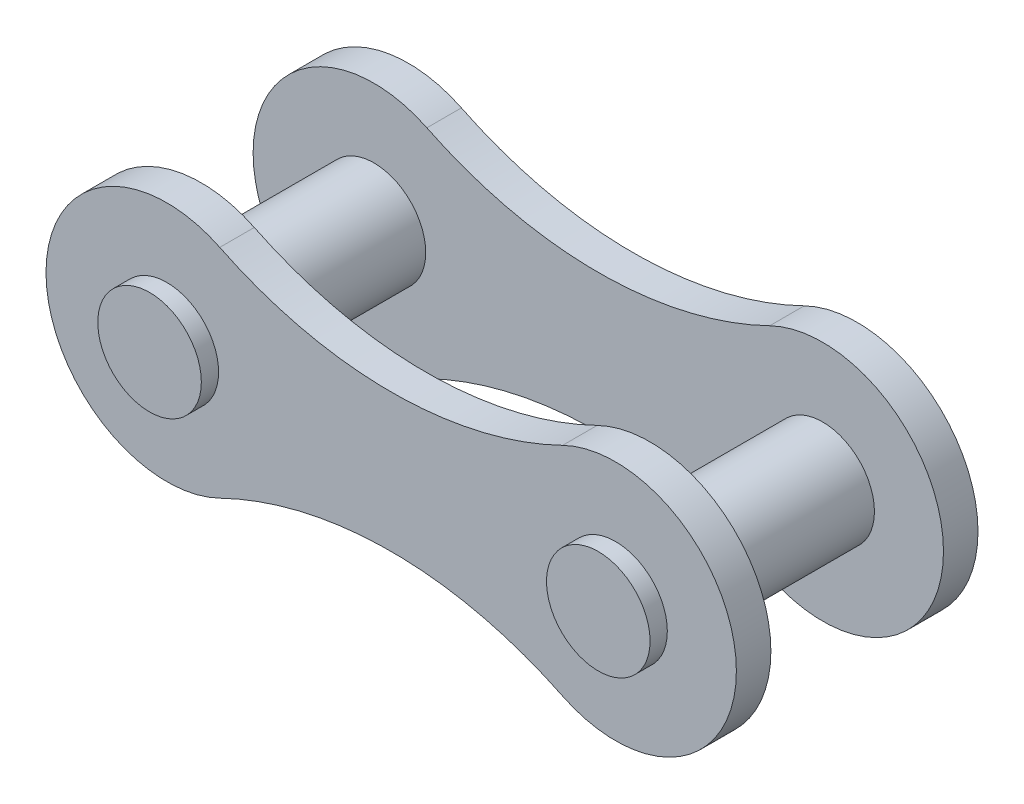
ISO-10303-21;
HEADER;
FILE_DESCRIPTION(('STEP AP214'),'2;1');
FILE_NAME('part.step','',(''),(''),'','','');
FILE_SCHEMA(('AUTOMOTIVE_DESIGN { 1 0 10303 214 1 1 1 1 }'));
ENDSEC;
DATA;
#1=APPLICATION_CONTEXT('core data for automotive mechanical design processes');
#2=APPLICATION_PROTOCOL_DEFINITION('international standard','automotive_design',2000,#1);
#3=PRODUCT_CONTEXT('',#1,'mechanical');
#4=PRODUCT('Part','Part','',(#3));
#5=PRODUCT_RELATED_PRODUCT_CATEGORY('part','',(#4));
#6=PRODUCT_DEFINITION_FORMATION('','',#4);
#7=PRODUCT_DEFINITION_CONTEXT('part definition',#1,'design');
#8=PRODUCT_DEFINITION('design','',#6,#7);
#9=PRODUCT_DEFINITION_SHAPE('','',#8);
#10=(LENGTH_UNIT() NAMED_UNIT(*) SI_UNIT(.MILLI.,.METRE.));
#11=(NAMED_UNIT(*) PLANE_ANGLE_UNIT() SI_UNIT($,.RADIAN.));
#12=(NAMED_UNIT(*) SI_UNIT($,.STERADIAN.) SOLID_ANGLE_UNIT());
#13=UNCERTAINTY_MEASURE_WITH_UNIT(LENGTH_MEASURE(1.E-05),#10,'distance_accuracy_value','');
#14=(GEOMETRIC_REPRESENTATION_CONTEXT(3) GLOBAL_UNCERTAINTY_ASSIGNED_CONTEXT((#13)) GLOBAL_UNIT_ASSIGNED_CONTEXT((#10,
#11,#12)) REPRESENTATION_CONTEXT('',''));
#15=CARTESIAN_POINT('',(0.,0.,0.));
#16=DIRECTION('',(0.,0.,1.));
#17=DIRECTION('',(1.,0.,0.));
#18=AXIS2_PLACEMENT_3D('',#15,#16,#17);
#19=CARTESIAN_POINT('',(3.25,6.66666666666667,1.));
#20=DIRECTION('',(0.,0.,1.));
#21=DIRECTION('',(1.,0.,0.));
#22=AXIS2_PLACEMENT_3D('',#19,#20,#21);
#23=PLANE('',#22);
#24=CARTESIAN_POINT('',(-6.5,0.,1.));
#25=DIRECTION('',(0.,0.,1.));
#26=DIRECTION('',(1.,0.,0.));
#27=AXIS2_PLACEMENT_3D('',#24,#25,#26);
#28=CIRCLE('',#27,1.5);
#29=CARTESIAN_POINT('',(-5.,0.,1.));
#30=VERTEX_POINT('',#29);
#31=EDGE_CURVE('E141',#30,#30,#28,.T.);
#32=ORIENTED_EDGE('',*,*,#31,.F.);
#33=EDGE_LOOP('',(#32));
#34=FACE_BOUND('',#33,.T.);
#35=CARTESIAN_POINT('',(6.5,0.,1.));
#36=DIRECTION('',(0.,0.,1.));
#37=DIRECTION('',(1.,0.,0.));
#38=AXIS2_PLACEMENT_3D('',#35,#36,#37);
#39=CIRCLE('',#38,1.5);
#40=CARTESIAN_POINT('',(8.,0.,1.));
#41=VERTEX_POINT('',#40);
#42=EDGE_CURVE('E271',#41,#41,#39,.T.);
#43=ORIENTED_EDGE('',*,*,#42,.F.);
#44=EDGE_LOOP('',(#43));
#45=FACE_BOUND('',#44,.T.);
#46=CARTESIAN_POINT('',(0.,13.3333333333333,1.));
#47=DIRECTION('',(0.,0.,-1.));
#48=DIRECTION('',(1.,0.,0.));
#49=AXIS2_PLACEMENT_3D('',#46,#47,#48);
#50=CIRCLE('',#49,11.3333333333333);
#51=CARTESIAN_POINT('',(4.96629213483146,3.14606741573034,1.));
#52=VERTEX_POINT('',#51);
#53=CARTESIAN_POINT('',(-4.96629213483146,3.14606741573034,1.));
#54=VERTEX_POINT('',#53);
#55=EDGE_CURVE('E168',#52,#54,#50,.T.);
#56=ORIENTED_EDGE('',*,*,#55,.T.);
#57=CARTESIAN_POINT('',(-6.5,0.,1.));
#58=DIRECTION('',(0.,0.,1.));
#59=DIRECTION('',(-1.,0.,0.));
#60=AXIS2_PLACEMENT_3D('',#57,#58,#59);
#61=CIRCLE('',#60,3.5);
#62=CARTESIAN_POINT('',(-4.96629213483146,-3.14606741573034,1.));
#63=VERTEX_POINT('',#62);
#64=EDGE_CURVE('E85',#54,#63,#61,.T.);
#65=ORIENTED_EDGE('',*,*,#64,.T.);
#66=CARTESIAN_POINT('',(0.,-13.3333333333333,1.));
#67=DIRECTION('',(0.,0.,-1.));
#68=DIRECTION('',(-1.,0.,0.));
#69=AXIS2_PLACEMENT_3D('',#66,#67,#68);
#70=CIRCLE('',#69,11.3333333333333);
#71=CARTESIAN_POINT('',(4.96629213483146,-3.14606741573034,1.));
#72=VERTEX_POINT('',#71);
#73=EDGE_CURVE('E171',#63,#72,#70,.T.);
#74=ORIENTED_EDGE('',*,*,#73,.T.);
#75=CARTESIAN_POINT('',(6.5,0.,1.));
#76=DIRECTION('',(0.,0.,1.));
#77=DIRECTION('',(1.,0.,0.));
#78=AXIS2_PLACEMENT_3D('',#75,#76,#77);
#79=CIRCLE('',#78,3.5);
#80=EDGE_CURVE('E54',#72,#52,#79,.T.);
#81=ORIENTED_EDGE('',*,*,#80,.T.);
#82=EDGE_LOOP('',(#56,#65,#74,#81));
#83=FACE_BOUND('',#82,.T.);
#84=ADVANCED_FACE('F37',(#34,#45,#83),#23,.T.);
#85=CARTESIAN_POINT('',(3.25,6.66666666666667,0.));
#86=DIRECTION('',(0.,0.,1.));
#87=DIRECTION('',(1.,0.,0.));
#88=AXIS2_PLACEMENT_3D('',#85,#86,#87);
#89=PLANE('',#88);
#90=CARTESIAN_POINT('',(0.,13.3333333333333,0.));
#91=DIRECTION('',(0.,0.,-1.));
#92=DIRECTION('',(1.,0.,0.));
#93=AXIS2_PLACEMENT_3D('',#90,#91,#92);
#94=CIRCLE('',#93,11.3333333333333);
#95=CARTESIAN_POINT('',(4.96629213483146,3.14606741573034,0.));
#96=VERTEX_POINT('',#95);
#97=CARTESIAN_POINT('',(-4.96629213483146,3.14606741573034,0.));
#98=VERTEX_POINT('',#97);
#99=EDGE_CURVE('E167',#96,#98,#94,.T.);
#100=ORIENTED_EDGE('',*,*,#99,.F.);
#101=CARTESIAN_POINT('',(6.5,0.,0.));
#102=DIRECTION('',(0.,0.,1.));
#103=DIRECTION('',(1.,0.,0.));
#104=AXIS2_PLACEMENT_3D('',#101,#102,#103);
#105=CIRCLE('',#104,3.5);
#106=CARTESIAN_POINT('',(4.96629213483146,-3.14606741573034,0.));
#107=VERTEX_POINT('',#106);
#108=EDGE_CURVE('E78',#107,#96,#105,.T.);
#109=ORIENTED_EDGE('',*,*,#108,.F.);
#110=CARTESIAN_POINT('',(0.,-13.3333333333333,0.));
#111=DIRECTION('',(0.,0.,-1.));
#112=DIRECTION('',(-1.,0.,0.));
#113=AXIS2_PLACEMENT_3D('',#110,#111,#112);
#114=CIRCLE('',#113,11.3333333333333);
#115=CARTESIAN_POINT('',(-4.96629213483146,-3.14606741573034,0.));
#116=VERTEX_POINT('',#115);
#117=EDGE_CURVE('E72',#116,#107,#114,.T.);
#118=ORIENTED_EDGE('',*,*,#117,.F.);
#119=CARTESIAN_POINT('',(-6.5,0.,0.));
#120=DIRECTION('',(0.,0.,1.));
#121=DIRECTION('',(-1.,0.,0.));
#122=AXIS2_PLACEMENT_3D('',#119,#120,#121);
#123=CIRCLE('',#122,3.5);
#124=EDGE_CURVE('E177',#98,#116,#123,.T.);
#125=ORIENTED_EDGE('',*,*,#124,.F.);
#126=EDGE_LOOP('',(#100,#109,#118,#125));
#127=FACE_BOUND('',#126,.T.);
#128=CARTESIAN_POINT('',(6.5,0.,0.));
#129=DIRECTION('',(0.,0.,1.));
#130=DIRECTION('',(1.,0.,0.));
#131=AXIS2_PLACEMENT_3D('',#128,#129,#130);
#132=CIRCLE('',#131,1.5);
#133=CARTESIAN_POINT('',(8.,0.,0.));
#134=VERTEX_POINT('',#133);
#135=EDGE_CURVE('E164',#134,#134,#132,.F.);
#136=ORIENTED_EDGE('',*,*,#135,.F.);
#137=EDGE_LOOP('',(#136));
#138=FACE_BOUND('',#137,.T.);
#139=CARTESIAN_POINT('',(-6.5,0.,0.));
#140=DIRECTION('',(0.,0.,1.));
#141=DIRECTION('',(1.,0.,0.));
#142=AXIS2_PLACEMENT_3D('',#139,#140,#141);
#143=CIRCLE('',#142,1.5);
#144=CARTESIAN_POINT('',(-5.,0.,0.));
#145=VERTEX_POINT('',#144);
#146=EDGE_CURVE('E158',#145,#145,#143,.F.);
#147=ORIENTED_EDGE('',*,*,#146,.F.);
#148=EDGE_LOOP('',(#147));
#149=FACE_BOUND('',#148,.T.);
#150=ADVANCED_FACE('F187',(#127,#138,#149),#89,.F.);
#151=CARTESIAN_POINT('',(0.,13.3333333333333,1.));
#152=DIRECTION('',(0.,0.,-1.));
#153=DIRECTION('',(-1.,0.,0.));
#154=AXIS2_PLACEMENT_3D('',#151,#152,#153);
#155=CYLINDRICAL_SURFACE('',#154,11.3333333333333);
#156=ORIENTED_EDGE('',*,*,#99,.T.);
#157=DIRECTION('',(0.,0.,-1.));
#158=VECTOR('',#157,1.);
#159=CARTESIAN_POINT('',(-4.96629213483146,3.14606741573034,1.));
#160=LINE('',#159,#158);
#161=EDGE_CURVE('E11',#54,#98,#160,.T.);
#162=ORIENTED_EDGE('',*,*,#161,.F.);
#163=ORIENTED_EDGE('',*,*,#55,.F.);
#164=DIRECTION('',(0.,0.,-1.));
#165=VECTOR('',#164,1.);
#166=CARTESIAN_POINT('',(4.96629213483146,3.14606741573034,1.));
#167=LINE('',#166,#165);
#168=EDGE_CURVE('E174',#52,#96,#167,.T.);
#169=ORIENTED_EDGE('',*,*,#168,.T.);
#170=EDGE_LOOP('',(#156,#162,#163,#169));
#171=FACE_BOUND('',#170,.T.);
#172=ADVANCED_FACE('F39',(#171),#155,.F.);
#173=CARTESIAN_POINT('',(-6.5,0.,1.));
#174=DIRECTION('',(0.,0.,-1.));
#175=DIRECTION('',(-1.,0.,0.));
#176=AXIS2_PLACEMENT_3D('',#173,#174,#175);
#177=CYLINDRICAL_SURFACE('',#176,3.5);
#178=ORIENTED_EDGE('',*,*,#124,.T.);
#179=DIRECTION('',(0.,0.,-1.));
#180=VECTOR('',#179,1.);
#181=CARTESIAN_POINT('',(-4.96629213483146,-3.14606741573034,1.));
#182=LINE('',#181,#180);
#183=EDGE_CURVE('E46',#63,#116,#182,.T.);
#184=ORIENTED_EDGE('',*,*,#183,.F.);
#185=ORIENTED_EDGE('',*,*,#64,.F.);
#186=ORIENTED_EDGE('',*,*,#161,.T.);
#187=EDGE_LOOP('',(#178,#184,#185,#186));
#188=FACE_BOUND('',#187,.T.);
#189=ADVANCED_FACE('F203',(#188),#177,.T.);
#190=CARTESIAN_POINT('',(0.,-13.3333333333333,1.));
#191=DIRECTION('',(0.,0.,-1.));
#192=DIRECTION('',(-1.,0.,0.));
#193=AXIS2_PLACEMENT_3D('',#190,#191,#192);
#194=CYLINDRICAL_SURFACE('',#193,11.3333333333333);
#195=ORIENTED_EDGE('',*,*,#117,.T.);
#196=DIRECTION('',(0.,0.,-1.));
#197=VECTOR('',#196,1.);
#198=CARTESIAN_POINT('',(4.96629213483146,-3.14606741573034,1.));
#199=LINE('',#198,#197);
#200=EDGE_CURVE('E182',#72,#107,#199,.T.);
#201=ORIENTED_EDGE('',*,*,#200,.F.);
#202=ORIENTED_EDGE('',*,*,#73,.F.);
#203=ORIENTED_EDGE('',*,*,#183,.T.);
#204=EDGE_LOOP('',(#195,#201,#202,#203));
#205=FACE_BOUND('',#204,.T.);
#206=ADVANCED_FACE('F184',(#205),#194,.F.);
#207=CARTESIAN_POINT('',(6.5,0.,1.));
#208=DIRECTION('',(0.,0.,-1.));
#209=DIRECTION('',(-1.,0.,0.));
#210=AXIS2_PLACEMENT_3D('',#207,#208,#209);
#211=CYLINDRICAL_SURFACE('',#210,3.5);
#212=ORIENTED_EDGE('',*,*,#108,.T.);
#213=ORIENTED_EDGE('',*,*,#168,.F.);
#214=ORIENTED_EDGE('',*,*,#80,.F.);
#215=ORIENTED_EDGE('',*,*,#200,.T.);
#216=EDGE_LOOP('',(#212,#213,#214,#215));
#217=FACE_BOUND('',#216,.T.);
#218=ADVANCED_FACE('F192',(#217),#211,.T.);
#219=CARTESIAN_POINT('',(6.5,0.,-0.5));
#220=DIRECTION('',(0.,0.,1.));
#221=DIRECTION('',(1.,0.,0.));
#222=AXIS2_PLACEMENT_3D('',#219,#220,#221);
#223=CYLINDRICAL_SURFACE('',#222,1.5);
#224=CARTESIAN_POINT('',(6.5,0.,-0.5));
#225=DIRECTION('',(0.,0.,-1.));
#226=DIRECTION('',(-1.,0.,0.));
#227=AXIS2_PLACEMENT_3D('',#224,#225,#226);
#228=CIRCLE('',#227,1.5);
#229=CARTESIAN_POINT('',(5.,0.,-0.5));
#230=VERTEX_POINT('',#229);
#231=EDGE_CURVE('E161',#230,#230,#228,.T.);
#232=ORIENTED_EDGE('',*,*,#231,.F.);
#233=EDGE_LOOP('',(#232));
#234=FACE_BOUND('',#233,.T.);
#235=ORIENTED_EDGE('',*,*,#135,.T.);
#236=EDGE_LOOP('',(#235));
#237=FACE_BOUND('',#236,.T.);
#238=ADVANCED_FACE('F194',(#234,#237),#223,.T.);
#239=CARTESIAN_POINT('',(6.5,0.,-0.5));
#240=DIRECTION('',(0.,0.,-1.));
#241=DIRECTION('',(-1.,0.,0.));
#242=AXIS2_PLACEMENT_3D('',#239,#240,#241);
#243=PLANE('',#242);
#244=ORIENTED_EDGE('',*,*,#231,.T.);
#245=EDGE_LOOP('',(#244));
#246=FACE_BOUND('',#245,.T.);
#247=ADVANCED_FACE('F200',(#246),#243,.T.);
#248=CARTESIAN_POINT('',(-6.5,0.,-0.5));
#249=DIRECTION('',(0.,0.,1.));
#250=DIRECTION('',(1.,0.,0.));
#251=AXIS2_PLACEMENT_3D('',#248,#249,#250);
#252=CYLINDRICAL_SURFACE('',#251,1.5);
#253=CARTESIAN_POINT('',(-6.5,0.,-0.5));
#254=DIRECTION('',(0.,0.,-1.));
#255=DIRECTION('',(-1.,0.,0.));
#256=AXIS2_PLACEMENT_3D('',#253,#254,#255);
#257=CIRCLE('',#256,1.5);
#258=CARTESIAN_POINT('',(-8.,0.,-0.5));
#259=VERTEX_POINT('',#258);
#260=EDGE_CURVE('E155',#259,#259,#257,.T.);
#261=ORIENTED_EDGE('',*,*,#260,.F.);
#262=EDGE_LOOP('',(#261));
#263=FACE_BOUND('',#262,.T.);
#264=ORIENTED_EDGE('',*,*,#146,.T.);
#265=EDGE_LOOP('',(#264));
#266=FACE_BOUND('',#265,.T.);
#267=ADVANCED_FACE('F217',(#263,#266),#252,.T.);
#268=CARTESIAN_POINT('',(-6.5,0.,-0.5));
#269=DIRECTION('',(0.,0.,-1.));
#270=DIRECTION('',(-1.,0.,0.));
#271=AXIS2_PLACEMENT_3D('',#268,#269,#270);
#272=PLANE('',#271);
#273=ORIENTED_EDGE('',*,*,#260,.T.);
#274=EDGE_LOOP('',(#273));
#275=FACE_BOUND('',#274,.T.);
#276=ADVANCED_FACE('F221',(#275),#272,.T.);
#277=CARTESIAN_POINT('',(-6.5,0.,6.));
#278=DIRECTION('',(0.,0.,-1.));
#279=DIRECTION('',(-1.,0.,0.));
#280=AXIS2_PLACEMENT_3D('',#277,#278,#279);
#281=CYLINDRICAL_SURFACE('',#280,1.5);
#282=CARTESIAN_POINT('',(-6.5,0.,7.));
#283=DIRECTION('',(0.,0.,1.));
#284=DIRECTION('',(1.,0.,0.));
#285=AXIS2_PLACEMENT_3D('',#282,#283,#284);
#286=CIRCLE('',#285,1.5);
#287=CARTESIAN_POINT('',(-5.,0.,7.));
#288=VERTEX_POINT('',#287);
#289=EDGE_CURVE('E280',#288,#288,#286,.T.);
#290=ORIENTED_EDGE('',*,*,#289,.T.);
#291=EDGE_LOOP('',(#290));
#292=FACE_BOUND('',#291,.T.);
#293=CARTESIAN_POINT('',(-6.5,0.,7.5));
#294=DIRECTION('',(0.,0.,1.));
#295=DIRECTION('',(1.,0.,0.));
#296=AXIS2_PLACEMENT_3D('',#293,#294,#295);
#297=CIRCLE('',#296,1.5);
#298=CARTESIAN_POINT('',(-5.,0.,7.5));
#299=VERTEX_POINT('',#298);
#300=EDGE_CURVE('E138',#299,#299,#297,.T.);
#301=ORIENTED_EDGE('',*,*,#300,.F.);
#302=EDGE_LOOP('',(#301));
#303=FACE_BOUND('',#302,.T.);
#304=ADVANCED_FACE('F225',(#292,#303),#281,.T.);
#305=CARTESIAN_POINT('',(-6.5,0.,7.5));
#306=DIRECTION('',(0.,0.,1.));
#307=DIRECTION('',(1.,0.,0.));
#308=AXIS2_PLACEMENT_3D('',#305,#306,#307);
#309=PLANE('',#308);
#310=ORIENTED_EDGE('',*,*,#300,.T.);
#311=EDGE_LOOP('',(#310));
#312=FACE_BOUND('',#311,.T.);
#313=ADVANCED_FACE('F229',(#312),#309,.T.);
#314=CARTESIAN_POINT('',(-3.25,-6.66666666666667,7.));
#315=DIRECTION('',(0.,0.,1.));
#316=DIRECTION('',(1.,0.,0.));
#317=AXIS2_PLACEMENT_3D('',#314,#315,#316);
#318=PLANE('',#317);
#319=ORIENTED_EDGE('',*,*,#289,.F.);
#320=EDGE_LOOP('',(#319));
#321=FACE_BOUND('',#320,.T.);
#322=CARTESIAN_POINT('',(-6.5,0.,7.));
#323=DIRECTION('',(0.,0.,1.));
#324=DIRECTION('',(1.,0.,0.));
#325=AXIS2_PLACEMENT_3D('',#322,#323,#324);
#326=CIRCLE('',#325,3.5);
#327=CARTESIAN_POINT('',(-4.96629213483145,3.14606741573034,7.));
#328=VERTEX_POINT('',#327);
#329=CARTESIAN_POINT('',(-4.96629213483146,-3.14606741573034,7.));
#330=VERTEX_POINT('',#329);
#331=EDGE_CURVE('E123',#328,#330,#326,.T.);
#332=ORIENTED_EDGE('',*,*,#331,.T.);
#333=CARTESIAN_POINT('',(0.,-13.3333333333333,7.));
#334=DIRECTION('',(0.,0.,-1.));
#335=DIRECTION('',(1.,0.,0.));
#336=AXIS2_PLACEMENT_3D('',#333,#334,#335);
#337=CIRCLE('',#336,11.3333333333333);
#338=CARTESIAN_POINT('',(4.96629213483146,-3.14606741573034,7.));
#339=VERTEX_POINT('',#338);
#340=EDGE_CURVE('E112',#330,#339,#337,.T.);
#341=ORIENTED_EDGE('',*,*,#340,.T.);
#342=CARTESIAN_POINT('',(6.5,0.,7.));
#343=DIRECTION('',(0.,0.,1.));
#344=DIRECTION('',(1.,0.,0.));
#345=AXIS2_PLACEMENT_3D('',#342,#343,#344);
#346=CIRCLE('',#345,3.5);
#347=CARTESIAN_POINT('',(4.96629213483145,3.14606741573033,7.));
#348=VERTEX_POINT('',#347);
#349=EDGE_CURVE('E122',#339,#348,#346,.T.);
#350=ORIENTED_EDGE('',*,*,#349,.T.);
#351=CARTESIAN_POINT('',(0.,13.3333333333333,7.));
#352=DIRECTION('',(0.,0.,-1.));
#353=DIRECTION('',(1.,0.,0.));
#354=AXIS2_PLACEMENT_3D('',#351,#352,#353);
#355=CIRCLE('',#354,11.3333333333333);
#356=EDGE_CURVE('E129',#348,#328,#355,.T.);
#357=ORIENTED_EDGE('',*,*,#356,.T.);
#358=EDGE_LOOP('',(#332,#341,#350,#357));
#359=FACE_BOUND('',#358,.T.);
#360=CARTESIAN_POINT('',(6.5,0.,7.));
#361=DIRECTION('',(0.,0.,1.));
#362=DIRECTION('',(1.,0.,0.));
#363=AXIS2_PLACEMENT_3D('',#360,#361,#362);
#364=CIRCLE('',#363,1.5);
#365=CARTESIAN_POINT('',(8.,0.,7.));
#366=VERTEX_POINT('',#365);
#367=EDGE_CURVE('E275',#366,#366,#364,.T.);
#368=ORIENTED_EDGE('',*,*,#367,.F.);
#369=EDGE_LOOP('',(#368));
#370=FACE_BOUND('',#369,.T.);
#371=ADVANCED_FACE('F126',(#321,#359,#370),#318,.T.);
#372=CARTESIAN_POINT('',(-3.25,-6.66666666666667,6.));
#373=DIRECTION('',(0.,0.,1.));
#374=DIRECTION('',(1.,0.,0.));
#375=AXIS2_PLACEMENT_3D('',#372,#373,#374);
#376=PLANE('',#375);
#377=CARTESIAN_POINT('',(6.5,0.,6.));
#378=DIRECTION('',(0.,0.,1.));
#379=DIRECTION('',(1.,0.,0.));
#380=AXIS2_PLACEMENT_3D('',#377,#378,#379);
#381=CIRCLE('',#380,1.5);
#382=CARTESIAN_POINT('',(8.,0.,6.));
#383=VERTEX_POINT('',#382);
#384=EDGE_CURVE('E152',#383,#383,#381,.F.);
#385=ORIENTED_EDGE('',*,*,#384,.F.);
#386=EDGE_LOOP('',(#385));
#387=FACE_BOUND('',#386,.T.);
#388=CARTESIAN_POINT('',(-6.5,0.,6.));
#389=DIRECTION('',(0.,0.,1.));
#390=DIRECTION('',(1.,0.,0.));
#391=AXIS2_PLACEMENT_3D('',#388,#389,#390);
#392=CIRCLE('',#391,3.5);
#393=CARTESIAN_POINT('',(-4.96629213483145,3.14606741573034,6.));
#394=VERTEX_POINT('',#393);
#395=CARTESIAN_POINT('',(-4.96629213483146,-3.14606741573034,6.));
#396=VERTEX_POINT('',#395);
#397=EDGE_CURVE('E137',#394,#396,#392,.T.);
#398=ORIENTED_EDGE('',*,*,#397,.F.);
#399=CARTESIAN_POINT('',(0.,13.3333333333333,6.));
#400=DIRECTION('',(0.,0.,-1.));
#401=DIRECTION('',(1.,0.,0.));
#402=AXIS2_PLACEMENT_3D('',#399,#400,#401);
#403=CIRCLE('',#402,11.3333333333333);
#404=CARTESIAN_POINT('',(4.96629213483145,3.14606741573033,6.));
#405=VERTEX_POINT('',#404);
#406=EDGE_CURVE('E133',#405,#394,#403,.T.);
#407=ORIENTED_EDGE('',*,*,#406,.F.);
#408=CARTESIAN_POINT('',(6.5,0.,6.));
#409=DIRECTION('',(0.,0.,1.));
#410=DIRECTION('',(1.,0.,0.));
#411=AXIS2_PLACEMENT_3D('',#408,#409,#410);
#412=CIRCLE('',#411,3.5);
#413=CARTESIAN_POINT('',(4.96629213483146,-3.14606741573034,6.));
#414=VERTEX_POINT('',#413);
#415=EDGE_CURVE('E289',#414,#405,#412,.T.);
#416=ORIENTED_EDGE('',*,*,#415,.F.);
#417=CARTESIAN_POINT('',(0.,-13.3333333333333,6.));
#418=DIRECTION('',(0.,0.,-1.));
#419=DIRECTION('',(1.,0.,0.));
#420=AXIS2_PLACEMENT_3D('',#417,#418,#419);
#421=CIRCLE('',#420,11.3333333333333);
#422=EDGE_CURVE('E287',#396,#414,#421,.T.);
#423=ORIENTED_EDGE('',*,*,#422,.F.);
#424=EDGE_LOOP('',(#398,#407,#416,#423));
#425=FACE_BOUND('',#424,.T.);
#426=CARTESIAN_POINT('',(-6.5,0.,6.));
#427=DIRECTION('',(0.,0.,1.));
#428=DIRECTION('',(1.,0.,0.));
#429=AXIS2_PLACEMENT_3D('',#426,#427,#428);
#430=CIRCLE('',#429,1.5);
#431=CARTESIAN_POINT('',(-5.,0.,6.));
#432=VERTEX_POINT('',#431);
#433=EDGE_CURVE('E149',#432,#432,#430,.T.);
#434=ORIENTED_EDGE('',*,*,#433,.T.);
#435=EDGE_LOOP('',(#434));
#436=FACE_BOUND('',#435,.T.);
#437=ADVANCED_FACE('F237',(#387,#425,#436),#376,.F.);
#438=CARTESIAN_POINT('',(-6.5,0.,7.));
#439=DIRECTION('',(0.,0.,-1.));
#440=DIRECTION('',(-1.,0.,0.));
#441=AXIS2_PLACEMENT_3D('',#438,#439,#440);
#442=CYLINDRICAL_SURFACE('',#441,3.5);
#443=ORIENTED_EDGE('',*,*,#397,.T.);
#444=DIRECTION('',(0.,0.,-1.));
#445=VECTOR('',#444,1.);
#446=CARTESIAN_POINT('',(-4.96629213483146,-3.14606741573034,7.));
#447=LINE('',#446,#445);
#448=EDGE_CURVE('E116',#330,#396,#447,.T.);
#449=ORIENTED_EDGE('',*,*,#448,.F.);
#450=ORIENTED_EDGE('',*,*,#331,.F.);
#451=DIRECTION('',(0.,0.,-1.));
#452=VECTOR('',#451,1.);
#453=CARTESIAN_POINT('',(-4.96629213483145,3.14606741573034,7.));
#454=LINE('',#453,#452);
#455=EDGE_CURVE('E285',#328,#394,#454,.T.);
#456=ORIENTED_EDGE('',*,*,#455,.T.);
#457=EDGE_LOOP('',(#443,#449,#450,#456));
#458=FACE_BOUND('',#457,.T.);
#459=ADVANCED_FACE('F135',(#458),#442,.T.);
#460=CARTESIAN_POINT('',(0.,-13.3333333333333,7.));
#461=DIRECTION('',(0.,0.,-1.));
#462=DIRECTION('',(-1.,0.,0.));
#463=AXIS2_PLACEMENT_3D('',#460,#461,#462);
#464=CYLINDRICAL_SURFACE('',#463,11.3333333333333);
#465=ORIENTED_EDGE('',*,*,#422,.T.);
#466=DIRECTION('',(0.,0.,-1.));
#467=VECTOR('',#466,1.);
#468=CARTESIAN_POINT('',(4.96629213483146,-3.14606741573034,7.));
#469=LINE('',#468,#467);
#470=EDGE_CURVE('E119',#339,#414,#469,.T.);
#471=ORIENTED_EDGE('',*,*,#470,.F.);
#472=ORIENTED_EDGE('',*,*,#340,.F.);
#473=ORIENTED_EDGE('',*,*,#448,.T.);
#474=EDGE_LOOP('',(#465,#471,#472,#473));
#475=FACE_BOUND('',#474,.T.);
#476=ADVANCED_FACE('F114',(#475),#464,.F.);
#477=CARTESIAN_POINT('',(6.5,0.,7.));
#478=DIRECTION('',(0.,0.,-1.));
#479=DIRECTION('',(-1.,0.,0.));
#480=AXIS2_PLACEMENT_3D('',#477,#478,#479);
#481=CYLINDRICAL_SURFACE('',#480,3.5);
#482=ORIENTED_EDGE('',*,*,#415,.T.);
#483=DIRECTION('',(0.,0.,-1.));
#484=VECTOR('',#483,1.);
#485=CARTESIAN_POINT('',(4.96629213483145,3.14606741573033,7.));
#486=LINE('',#485,#484);
#487=EDGE_CURVE('E143',#348,#405,#486,.T.);
#488=ORIENTED_EDGE('',*,*,#487,.F.);
#489=ORIENTED_EDGE('',*,*,#349,.F.);
#490=ORIENTED_EDGE('',*,*,#470,.T.);
#491=EDGE_LOOP('',(#482,#488,#489,#490));
#492=FACE_BOUND('',#491,.T.);
#493=ADVANCED_FACE('F240',(#492),#481,.T.);
#494=CARTESIAN_POINT('',(0.,13.3333333333333,7.));
#495=DIRECTION('',(0.,0.,-1.));
#496=DIRECTION('',(-1.,0.,0.));
#497=AXIS2_PLACEMENT_3D('',#494,#495,#496);
#498=CYLINDRICAL_SURFACE('',#497,11.3333333333333);
#499=ORIENTED_EDGE('',*,*,#406,.T.);
#500=ORIENTED_EDGE('',*,*,#455,.F.);
#501=ORIENTED_EDGE('',*,*,#356,.F.);
#502=ORIENTED_EDGE('',*,*,#487,.T.);
#503=EDGE_LOOP('',(#499,#500,#501,#502));
#504=FACE_BOUND('',#503,.T.);
#505=ADVANCED_FACE('F243',(#504),#498,.F.);
#506=ORIENTED_EDGE('',*,*,#31,.T.);
#507=EDGE_LOOP('',(#506));
#508=FACE_BOUND('',#507,.T.);
#509=ORIENTED_EDGE('',*,*,#433,.F.);
#510=EDGE_LOOP('',(#509));
#511=FACE_BOUND('',#510,.T.);
#512=ADVANCED_FACE('F231',(#508,#511),#281,.T.);
#513=CARTESIAN_POINT('',(6.5,0.,7.5));
#514=DIRECTION('',(0.,0.,-1.));
#515=DIRECTION('',(-1.,0.,0.));
#516=AXIS2_PLACEMENT_3D('',#513,#514,#515);
#517=CYLINDRICAL_SURFACE('',#516,1.5);
#518=ORIENTED_EDGE('',*,*,#367,.T.);
#519=EDGE_LOOP('',(#518));
#520=FACE_BOUND('',#519,.T.);
#521=CARTESIAN_POINT('',(6.5,0.,7.5));
#522=DIRECTION('',(0.,0.,1.));
#523=DIRECTION('',(1.,0.,0.));
#524=AXIS2_PLACEMENT_3D('',#521,#522,#523);
#525=CIRCLE('',#524,1.5);
#526=CARTESIAN_POINT('',(8.,0.,7.5));
#527=VERTEX_POINT('',#526);
#528=EDGE_CURVE('E272',#527,#527,#525,.T.);
#529=ORIENTED_EDGE('',*,*,#528,.F.);
#530=EDGE_LOOP('',(#529));
#531=FACE_BOUND('',#530,.T.);
#532=ADVANCED_FACE('F254',(#520,#531),#517,.T.);
#533=CARTESIAN_POINT('',(6.5,0.,7.5));
#534=DIRECTION('',(0.,0.,1.));
#535=DIRECTION('',(1.,0.,0.));
#536=AXIS2_PLACEMENT_3D('',#533,#534,#535);
#537=PLANE('',#536);
#538=ORIENTED_EDGE('',*,*,#528,.T.);
#539=EDGE_LOOP('',(#538));
#540=FACE_BOUND('',#539,.T.);
#541=ADVANCED_FACE('F257',(#540),#537,.T.);
#542=CARTESIAN_POINT('',(6.5,0.,6.));
#543=DIRECTION('',(0.,0.,-1.));
#544=DIRECTION('',(-1.,0.,0.));
#545=AXIS2_PLACEMENT_3D('',#542,#543,#544);
#546=CYLINDRICAL_SURFACE('',#545,1.5);
#547=ORIENTED_EDGE('',*,*,#384,.T.);
#548=EDGE_LOOP('',(#547));
#549=FACE_BOUND('',#548,.T.);
#550=ORIENTED_EDGE('',*,*,#42,.T.);
#551=EDGE_LOOP('',(#550));
#552=FACE_BOUND('',#551,.T.);
#553=ADVANCED_FACE('F261',(#549,#552),#546,.T.);
#554=CLOSED_SHELL('',(#84,#150,#172,#189,#206,#218,#238,#247,#267,#276,#304,#313,#371,#437,#459,
#476,#493,#505,#512,#532,#541,#553));
#555=MANIFOLD_SOLID_BREP('B2',#554);
#556=ADVANCED_BREP_SHAPE_REPRESENTATION('',(#18,#555),#14);
#557=SHAPE_DEFINITION_REPRESENTATION(#9,#556);
ENDSEC;
END-ISO-10303-21;
